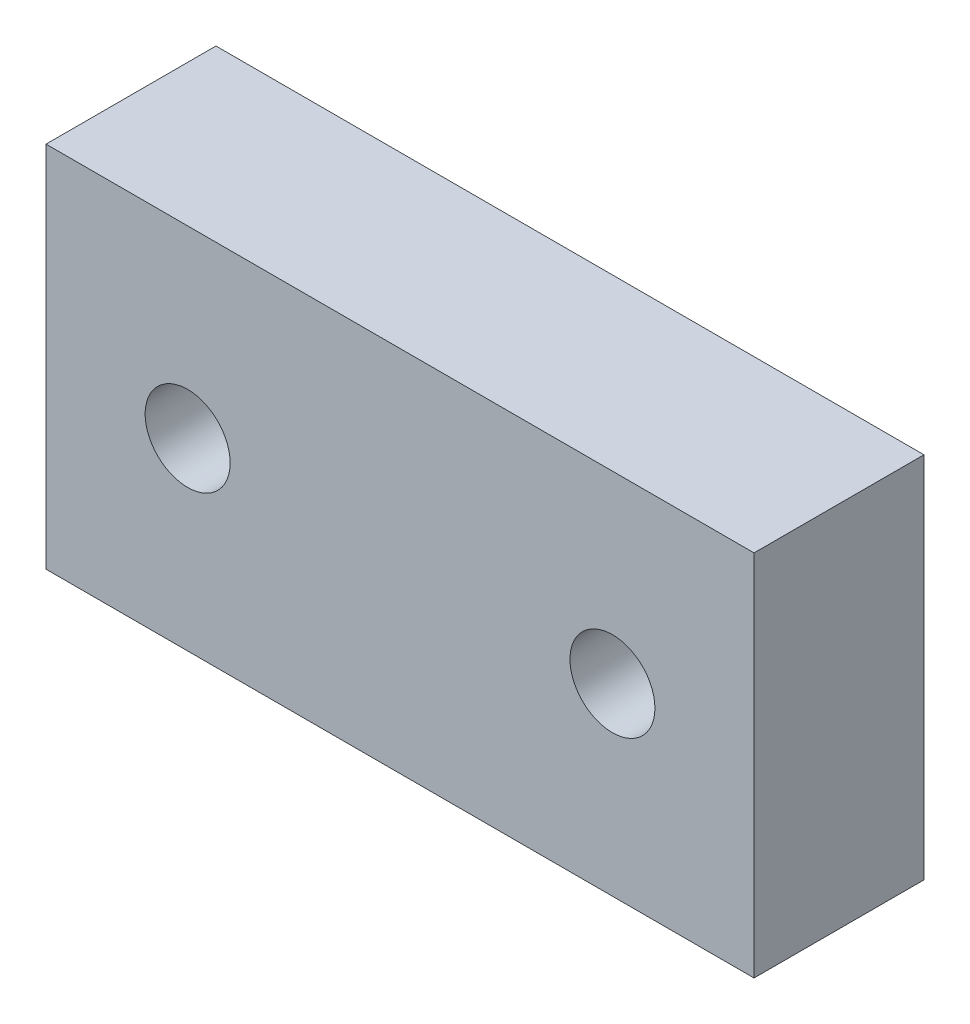
ISO-10303-21;
HEADER;
FILE_DESCRIPTION(('STEP AP214'),'2;1');
FILE_NAME('part.step','',(''),(''),'','','');
FILE_SCHEMA(('AUTOMOTIVE_DESIGN { 1 0 10303 214 1 1 1 1 }'));
ENDSEC;
DATA;
#1=APPLICATION_CONTEXT('core data for automotive mechanical design processes');
#2=APPLICATION_PROTOCOL_DEFINITION('international standard','automotive_design',2000,#1);
#3=PRODUCT_CONTEXT('',#1,'mechanical');
#4=PRODUCT('Part','Part','',(#3));
#5=PRODUCT_RELATED_PRODUCT_CATEGORY('part','',(#4));
#6=PRODUCT_DEFINITION_FORMATION('','',#4);
#7=PRODUCT_DEFINITION_CONTEXT('part definition',#1,'design');
#8=PRODUCT_DEFINITION('design','',#6,#7);
#9=PRODUCT_DEFINITION_SHAPE('','',#8);
#10=(LENGTH_UNIT() NAMED_UNIT(*) SI_UNIT(.MILLI.,.METRE.));
#11=(NAMED_UNIT(*) PLANE_ANGLE_UNIT() SI_UNIT($,.RADIAN.));
#12=(NAMED_UNIT(*) SI_UNIT($,.STERADIAN.) SOLID_ANGLE_UNIT());
#13=UNCERTAINTY_MEASURE_WITH_UNIT(LENGTH_MEASURE(1.E-05),#10,'distance_accuracy_value','');
#14=(GEOMETRIC_REPRESENTATION_CONTEXT(3) GLOBAL_UNCERTAINTY_ASSIGNED_CONTEXT((#13)) GLOBAL_UNIT_ASSIGNED_CONTEXT((#10,
#11,#12)) REPRESENTATION_CONTEXT('',''));
#15=CARTESIAN_POINT('',(0.,0.,0.));
#16=DIRECTION('',(0.,0.,1.));
#17=DIRECTION('',(1.,0.,0.));
#18=AXIS2_PLACEMENT_3D('',#15,#16,#17);
#19=CARTESIAN_POINT('',(0.,13.,6.));
#20=DIRECTION('',(0.,1.,0.));
#21=DIRECTION('',(0.,0.,1.));
#22=AXIS2_PLACEMENT_3D('',#19,#20,#21);
#23=PLANE('',#22);
#24=DIRECTION('',(1.,0.,0.));
#25=VECTOR('',#24,1.);
#26=CARTESIAN_POINT('',(0.,13.,0.));
#27=LINE('',#26,#25);
#28=CARTESIAN_POINT('',(0.,13.,0.));
#29=VERTEX_POINT('',#28);
#30=CARTESIAN_POINT('',(25.,13.,0.));
#31=VERTEX_POINT('',#30);
#32=EDGE_CURVE('E112',#29,#31,#27,.T.);
#33=ORIENTED_EDGE('',*,*,#32,.F.);
#34=DIRECTION('',(0.,0.,-1.));
#35=VECTOR('',#34,1.);
#36=CARTESIAN_POINT('',(0.,13.,6.));
#37=LINE('',#36,#35);
#38=CARTESIAN_POINT('',(0.,13.,6.));
#39=VERTEX_POINT('',#38);
#40=EDGE_CURVE('E11',#39,#29,#37,.T.);
#41=ORIENTED_EDGE('',*,*,#40,.F.);
#42=DIRECTION('',(1.,0.,0.));
#43=VECTOR('',#42,1.);
#44=CARTESIAN_POINT('',(0.,13.,6.));
#45=LINE('',#44,#43);
#46=CARTESIAN_POINT('',(25.,13.,6.));
#47=VERTEX_POINT('',#46);
#48=EDGE_CURVE('E99',#39,#47,#45,.T.);
#49=ORIENTED_EDGE('',*,*,#48,.T.);
#50=DIRECTION('',(0.,0.,-1.));
#51=VECTOR('',#50,1.);
#52=CARTESIAN_POINT('',(25.,13.,6.));
#53=LINE('',#52,#51);
#54=EDGE_CURVE('E78',#47,#31,#53,.T.);
#55=ORIENTED_EDGE('',*,*,#54,.T.);
#56=EDGE_LOOP('',(#33,#41,#49,#55));
#57=FACE_BOUND('',#56,.T.);
#58=ADVANCED_FACE('F38',(#57),#23,.T.);
#59=CARTESIAN_POINT('',(0.,0.,6.));
#60=DIRECTION('',(-1.,0.,0.));
#61=DIRECTION('',(0.,0.,1.));
#62=AXIS2_PLACEMENT_3D('',#59,#60,#61);
#63=PLANE('',#62);
#64=DIRECTION('',(0.,1.,0.));
#65=VECTOR('',#64,1.);
#66=CARTESIAN_POINT('',(0.,0.,0.));
#67=LINE('',#66,#65);
#68=CARTESIAN_POINT('',(0.,0.,0.));
#69=VERTEX_POINT('',#68);
#70=EDGE_CURVE('E90',#69,#29,#67,.T.);
#71=ORIENTED_EDGE('',*,*,#70,.F.);
#72=DIRECTION('',(0.,0.,-1.));
#73=VECTOR('',#72,1.);
#74=CARTESIAN_POINT('',(0.,0.,6.));
#75=LINE('',#74,#73);
#76=CARTESIAN_POINT('',(0.,0.,6.));
#77=VERTEX_POINT('',#76);
#78=EDGE_CURVE('E47',#77,#69,#75,.T.);
#79=ORIENTED_EDGE('',*,*,#78,.F.);
#80=DIRECTION('',(0.,1.,0.));
#81=VECTOR('',#80,1.);
#82=CARTESIAN_POINT('',(0.,0.,6.));
#83=LINE('',#82,#81);
#84=EDGE_CURVE('E88',#77,#39,#83,.T.);
#85=ORIENTED_EDGE('',*,*,#84,.T.);
#86=ORIENTED_EDGE('',*,*,#40,.T.);
#87=EDGE_LOOP('',(#71,#79,#85,#86));
#88=FACE_BOUND('',#87,.T.);
#89=ADVANCED_FACE('F86',(#88),#63,.T.);
#90=CARTESIAN_POINT('',(0.,0.,6.));
#91=DIRECTION('',(0.,1.,0.));
#92=DIRECTION('',(0.,0.,1.));
#93=AXIS2_PLACEMENT_3D('',#90,#91,#92);
#94=PLANE('',#93);
#95=DIRECTION('',(1.,0.,0.));
#96=VECTOR('',#95,1.);
#97=CARTESIAN_POINT('',(0.,0.,0.));
#98=LINE('',#97,#96);
#99=CARTESIAN_POINT('',(25.,0.,0.));
#100=VERTEX_POINT('',#99);
#101=EDGE_CURVE('E115',#69,#100,#98,.T.);
#102=ORIENTED_EDGE('',*,*,#101,.T.);
#103=DIRECTION('',(0.,0.,-1.));
#104=VECTOR('',#103,1.);
#105=CARTESIAN_POINT('',(25.,0.,6.));
#106=LINE('',#105,#104);
#107=CARTESIAN_POINT('',(25.,0.,6.));
#108=VERTEX_POINT('',#107);
#109=EDGE_CURVE('E93',#108,#100,#106,.T.);
#110=ORIENTED_EDGE('',*,*,#109,.F.);
#111=DIRECTION('',(1.,0.,0.));
#112=VECTOR('',#111,1.);
#113=CARTESIAN_POINT('',(0.,0.,6.));
#114=LINE('',#113,#112);
#115=EDGE_CURVE('E95',#77,#108,#114,.T.);
#116=ORIENTED_EDGE('',*,*,#115,.F.);
#117=ORIENTED_EDGE('',*,*,#78,.T.);
#118=EDGE_LOOP('',(#102,#110,#116,#117));
#119=FACE_BOUND('',#118,.T.);
#120=ADVANCED_FACE('F96',(#119),#94,.F.);
#121=CARTESIAN_POINT('',(5.,6.5,6.));
#122=DIRECTION('',(0.,0.,-1.));
#123=DIRECTION('',(-1.,0.,0.));
#124=AXIS2_PLACEMENT_3D('',#121,#122,#123);
#125=CYLINDRICAL_SURFACE('',#124,1.5);
#126=CARTESIAN_POINT('',(5.,6.5,6.));
#127=DIRECTION('',(0.,0.,1.));
#128=DIRECTION('',(1.,0.,0.));
#129=AXIS2_PLACEMENT_3D('',#126,#127,#128);
#130=CIRCLE('',#129,1.5);
#131=CARTESIAN_POINT('',(6.5,6.5,6.));
#132=VERTEX_POINT('',#131);
#133=EDGE_CURVE('E101',#132,#132,#130,.T.);
#134=ORIENTED_EDGE('',*,*,#133,.T.);
#135=EDGE_LOOP('',(#134));
#136=FACE_BOUND('',#135,.T.);
#137=CARTESIAN_POINT('',(5.,6.5,0.));
#138=DIRECTION('',(0.,0.,1.));
#139=DIRECTION('',(1.,0.,0.));
#140=AXIS2_PLACEMENT_3D('',#137,#138,#139);
#141=CIRCLE('',#140,1.5);
#142=CARTESIAN_POINT('',(6.5,6.5,0.));
#143=VERTEX_POINT('',#142);
#144=EDGE_CURVE('E109',#143,#143,#141,.T.);
#145=ORIENTED_EDGE('',*,*,#144,.F.);
#146=EDGE_LOOP('',(#145));
#147=FACE_BOUND('',#146,.T.);
#148=ADVANCED_FACE('F130',(#136,#147),#125,.F.);
#149=CARTESIAN_POINT('',(20.,6.5,6.));
#150=DIRECTION('',(0.,0.,-1.));
#151=DIRECTION('',(-1.,0.,0.));
#152=AXIS2_PLACEMENT_3D('',#149,#150,#151);
#153=CYLINDRICAL_SURFACE('',#152,1.5);
#154=CARTESIAN_POINT('',(20.,6.5,6.));
#155=DIRECTION('',(0.,0.,1.));
#156=DIRECTION('',(1.,0.,0.));
#157=AXIS2_PLACEMENT_3D('',#154,#155,#156);
#158=CIRCLE('',#157,1.5);
#159=CARTESIAN_POINT('',(21.5,6.5,6.));
#160=VERTEX_POINT('',#159);
#161=EDGE_CURVE('E118',#160,#160,#158,.T.);
#162=ORIENTED_EDGE('',*,*,#161,.T.);
#163=EDGE_LOOP('',(#162));
#164=FACE_BOUND('',#163,.T.);
#165=CARTESIAN_POINT('',(20.,6.5,0.));
#166=DIRECTION('',(0.,0.,1.));
#167=DIRECTION('',(1.,0.,0.));
#168=AXIS2_PLACEMENT_3D('',#165,#166,#167);
#169=CIRCLE('',#168,1.5);
#170=CARTESIAN_POINT('',(21.5,6.5,0.));
#171=VERTEX_POINT('',#170);
#172=EDGE_CURVE('E106',#171,#171,#169,.T.);
#173=ORIENTED_EDGE('',*,*,#172,.F.);
#174=EDGE_LOOP('',(#173));
#175=FACE_BOUND('',#174,.T.);
#176=ADVANCED_FACE('F40',(#164,#175),#153,.F.);
#177=CARTESIAN_POINT('',(25.,0.,6.));
#178=DIRECTION('',(-1.,0.,0.));
#179=DIRECTION('',(0.,0.,1.));
#180=AXIS2_PLACEMENT_3D('',#177,#178,#179);
#181=PLANE('',#180);
#182=DIRECTION('',(0.,1.,0.));
#183=VECTOR('',#182,1.);
#184=CARTESIAN_POINT('',(25.,0.,0.));
#185=LINE('',#184,#183);
#186=EDGE_CURVE('E71',#100,#31,#185,.T.);
#187=ORIENTED_EDGE('',*,*,#186,.T.);
#188=ORIENTED_EDGE('',*,*,#54,.F.);
#189=DIRECTION('',(0.,1.,0.));
#190=VECTOR('',#189,1.);
#191=CARTESIAN_POINT('',(25.,0.,6.));
#192=LINE('',#191,#190);
#193=EDGE_CURVE('E55',#108,#47,#192,.T.);
#194=ORIENTED_EDGE('',*,*,#193,.F.);
#195=ORIENTED_EDGE('',*,*,#109,.T.);
#196=EDGE_LOOP('',(#187,#188,#194,#195));
#197=FACE_BOUND('',#196,.T.);
#198=ADVANCED_FACE('F121',(#197),#181,.F.);
#199=CARTESIAN_POINT('',(0.,0.,6.));
#200=DIRECTION('',(0.,0.,1.));
#201=DIRECTION('',(1.,0.,0.));
#202=AXIS2_PLACEMENT_3D('',#199,#200,#201);
#203=PLANE('',#202);
#204=ORIENTED_EDGE('',*,*,#161,.F.);
#205=EDGE_LOOP('',(#204));
#206=FACE_BOUND('',#205,.T.);
#207=ORIENTED_EDGE('',*,*,#133,.F.);
#208=EDGE_LOOP('',(#207));
#209=FACE_BOUND('',#208,.T.);
#210=ORIENTED_EDGE('',*,*,#48,.F.);
#211=ORIENTED_EDGE('',*,*,#84,.F.);
#212=ORIENTED_EDGE('',*,*,#115,.T.);
#213=ORIENTED_EDGE('',*,*,#193,.T.);
#214=EDGE_LOOP('',(#210,#211,#212,#213));
#215=FACE_BOUND('',#214,.T.);
#216=ADVANCED_FACE('F98',(#206,#209,#215),#203,.T.);
#217=CARTESIAN_POINT('',(0.,0.,0.));
#218=DIRECTION('',(0.,0.,1.));
#219=DIRECTION('',(1.,0.,0.));
#220=AXIS2_PLACEMENT_3D('',#217,#218,#219);
#221=PLANE('',#220);
#222=ORIENTED_EDGE('',*,*,#172,.T.);
#223=EDGE_LOOP('',(#222));
#224=FACE_BOUND('',#223,.T.);
#225=ORIENTED_EDGE('',*,*,#144,.T.);
#226=EDGE_LOOP('',(#225));
#227=FACE_BOUND('',#226,.T.);
#228=ORIENTED_EDGE('',*,*,#32,.T.);
#229=ORIENTED_EDGE('',*,*,#186,.F.);
#230=ORIENTED_EDGE('',*,*,#101,.F.);
#231=ORIENTED_EDGE('',*,*,#70,.T.);
#232=EDGE_LOOP('',(#228,#229,#230,#231));
#233=FACE_BOUND('',#232,.T.);
#234=ADVANCED_FACE('F122',(#224,#227,#233),#221,.F.);
#235=CLOSED_SHELL('',(#58,#89,#120,#148,#176,#198,#216,#234));
#236=MANIFOLD_SOLID_BREP('B2',#235);
#237=ADVANCED_BREP_SHAPE_REPRESENTATION('',(#18,#236),#14);
#238=SHAPE_DEFINITION_REPRESENTATION(#9,#237);
ENDSEC;
END-ISO-10303-21;
